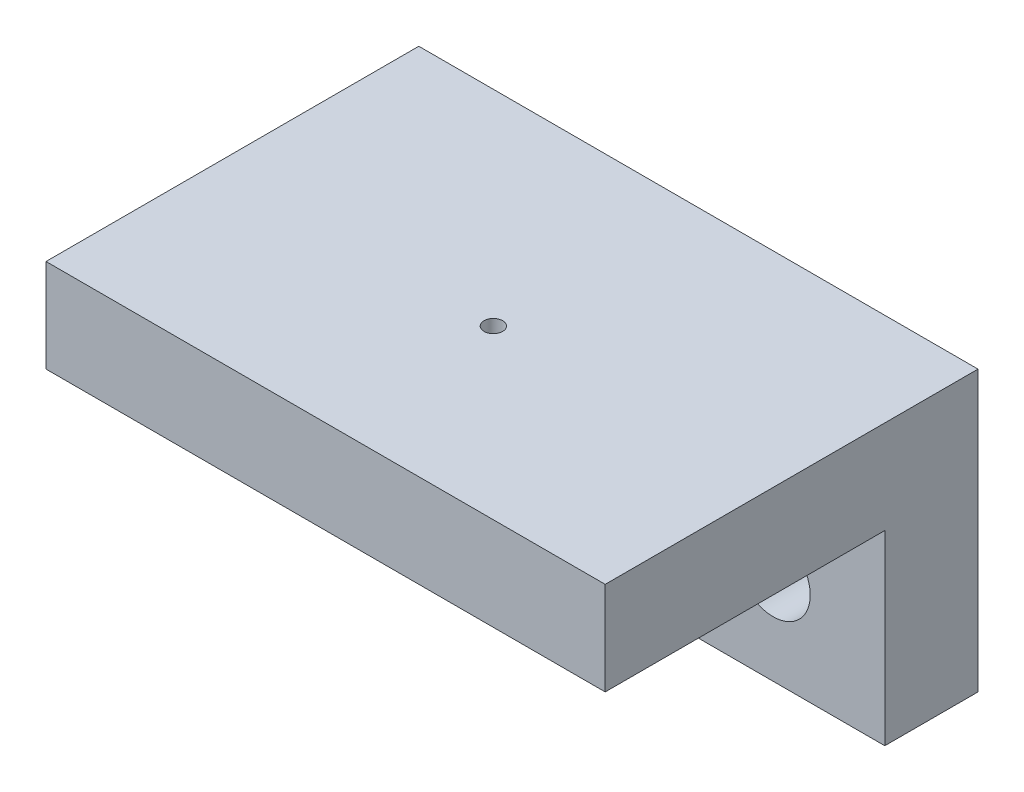
ISO-10303-21;
HEADER;
FILE_DESCRIPTION(('STEP AP214'),'2;1');
FILE_NAME('part.step','',(''),(''),'','','');
FILE_SCHEMA(('AUTOMOTIVE_DESIGN { 1 0 10303 214 1 1 1 1 }'));
ENDSEC;
DATA;
#1=APPLICATION_CONTEXT('core data for automotive mechanical design processes');
#2=APPLICATION_PROTOCOL_DEFINITION('international standard','automotive_design',2000,#1);
#3=PRODUCT_CONTEXT('',#1,'mechanical');
#4=PRODUCT('Part','Part','',(#3));
#5=PRODUCT_RELATED_PRODUCT_CATEGORY('part','',(#4));
#6=PRODUCT_DEFINITION_FORMATION('','',#4);
#7=PRODUCT_DEFINITION_CONTEXT('part definition',#1,'design');
#8=PRODUCT_DEFINITION('design','',#6,#7);
#9=PRODUCT_DEFINITION_SHAPE('','',#8);
#10=(LENGTH_UNIT() NAMED_UNIT(*) SI_UNIT(.MILLI.,.METRE.));
#11=(NAMED_UNIT(*) PLANE_ANGLE_UNIT() SI_UNIT($,.RADIAN.));
#12=(NAMED_UNIT(*) SI_UNIT($,.STERADIAN.) SOLID_ANGLE_UNIT());
#13=UNCERTAINTY_MEASURE_WITH_UNIT(LENGTH_MEASURE(1.E-05),#10,'distance_accuracy_value','');
#14=(GEOMETRIC_REPRESENTATION_CONTEXT(3) GLOBAL_UNCERTAINTY_ASSIGNED_CONTEXT((#13)) GLOBAL_UNIT_ASSIGNED_CONTEXT((#10,
#11,#12)) REPRESENTATION_CONTEXT('',''));
#15=CARTESIAN_POINT('',(0.,0.,0.));
#16=DIRECTION('',(0.,0.,1.));
#17=DIRECTION('',(1.,0.,0.));
#18=AXIS2_PLACEMENT_3D('',#15,#16,#17);
#19=CARTESIAN_POINT('',(0.,0.,5.));
#20=DIRECTION('',(0.,0.,-1.));
#21=DIRECTION('',(-1.,0.,0.));
#22=AXIS2_PLACEMENT_3D('',#19,#20,#21);
#23=PLANE('',#22);
#24=CARTESIAN_POINT('',(6.,5.,5.));
#25=DIRECTION('',(0.,0.,1.));
#26=DIRECTION('',(1.,0.,0.));
#27=AXIS2_PLACEMENT_3D('',#24,#25,#26);
#28=CIRCLE('',#27,2.);
#29=CARTESIAN_POINT('',(8.,5.,5.));
#30=VERTEX_POINT('',#29);
#31=EDGE_CURVE('E124',#30,#30,#28,.T.);
#32=ORIENTED_EDGE('',*,*,#31,.F.);
#33=EDGE_LOOP('',(#32));
#34=FACE_BOUND('',#33,.T.);
#35=CARTESIAN_POINT('',(24.,5.,5.));
#36=DIRECTION('',(0.,0.,1.));
#37=DIRECTION('',(1.,0.,0.));
#38=AXIS2_PLACEMENT_3D('',#35,#36,#37);
#39=CIRCLE('',#38,2.);
#40=CARTESIAN_POINT('',(26.,5.,5.));
#41=VERTEX_POINT('',#40);
#42=EDGE_CURVE('E115',#41,#41,#39,.T.);
#43=ORIENTED_EDGE('',*,*,#42,.F.);
#44=EDGE_LOOP('',(#43));
#45=FACE_BOUND('',#44,.T.);
#46=DIRECTION('',(1.,0.,0.));
#47=VECTOR('',#46,1.);
#48=CARTESIAN_POINT('',(0.,10.,5.));
#49=LINE('',#48,#47);
#50=CARTESIAN_POINT('',(0.,10.,5.));
#51=VERTEX_POINT('',#50);
#52=CARTESIAN_POINT('',(30.,10.,5.));
#53=VERTEX_POINT('',#52);
#54=EDGE_CURVE('E49',#51,#53,#49,.T.);
#55=ORIENTED_EDGE('',*,*,#54,.F.);
#56=DIRECTION('',(0.,-1.,0.));
#57=VECTOR('',#56,1.);
#58=CARTESIAN_POINT('',(0.,0.,5.));
#59=LINE('',#58,#57);
#60=CARTESIAN_POINT('',(0.,0.,5.));
#61=VERTEX_POINT('',#60);
#62=EDGE_CURVE('E86',#51,#61,#59,.T.);
#63=ORIENTED_EDGE('',*,*,#62,.T.);
#64=DIRECTION('',(1.,0.,0.));
#65=VECTOR('',#64,1.);
#66=CARTESIAN_POINT('',(0.,0.,5.));
#67=LINE('',#66,#65);
#68=CARTESIAN_POINT('',(30.,0.,5.));
#69=VERTEX_POINT('',#68);
#70=EDGE_CURVE('E55',#61,#69,#67,.T.);
#71=ORIENTED_EDGE('',*,*,#70,.T.);
#72=DIRECTION('',(0.,1.,0.));
#73=VECTOR('',#72,1.);
#74=CARTESIAN_POINT('',(30.,0.,5.));
#75=LINE('',#74,#73);
#76=EDGE_CURVE('E97',#69,#53,#75,.T.);
#77=ORIENTED_EDGE('',*,*,#76,.T.);
#78=EDGE_LOOP('',(#55,#63,#71,#77));
#79=FACE_BOUND('',#78,.T.);
#80=ADVANCED_FACE('F32',(#34,#45,#79),#23,.F.);
#81=CARTESIAN_POINT('',(0.,0.,5.));
#82=DIRECTION('',(1.,0.,0.));
#83=DIRECTION('',(0.,0.,-1.));
#84=AXIS2_PLACEMENT_3D('',#81,#82,#83);
#85=PLANE('',#84);
#86=DIRECTION('',(0.,-1.,0.));
#87=VECTOR('',#86,1.);
#88=CARTESIAN_POINT('',(0.,0.,0.));
#89=LINE('',#88,#87);
#90=CARTESIAN_POINT('',(0.,15.,0.));
#91=VERTEX_POINT('',#90);
#92=CARTESIAN_POINT('',(0.,0.,0.));
#93=VERTEX_POINT('',#92);
#94=EDGE_CURVE('E93',#91,#93,#89,.T.);
#95=ORIENTED_EDGE('',*,*,#94,.T.);
#96=DIRECTION('',(0.,0.,-1.));
#97=VECTOR('',#96,1.);
#98=CARTESIAN_POINT('',(0.,0.,5.));
#99=LINE('',#98,#97);
#100=EDGE_CURVE('E11',#61,#93,#99,.T.);
#101=ORIENTED_EDGE('',*,*,#100,.F.);
#102=ORIENTED_EDGE('',*,*,#62,.F.);
#103=DIRECTION('',(0.,0.,-1.));
#104=VECTOR('',#103,1.);
#105=CARTESIAN_POINT('',(0.,10.,20.));
#106=LINE('',#105,#104);
#107=CARTESIAN_POINT('',(0.,10.,20.));
#108=VERTEX_POINT('',#107);
#109=EDGE_CURVE('E101',#108,#51,#106,.T.);
#110=ORIENTED_EDGE('',*,*,#109,.F.);
#111=DIRECTION('',(0.,-1.,0.));
#112=VECTOR('',#111,1.);
#113=CARTESIAN_POINT('',(0.,15.,20.));
#114=LINE('',#113,#112);
#115=CARTESIAN_POINT('',(0.,15.,20.));
#116=VERTEX_POINT('',#115);
#117=EDGE_CURVE('E96',#116,#108,#114,.T.);
#118=ORIENTED_EDGE('',*,*,#117,.F.);
#119=DIRECTION('',(0.,0.,-1.));
#120=VECTOR('',#119,1.);
#121=CARTESIAN_POINT('',(0.,15.,5.));
#122=LINE('',#121,#120);
#123=EDGE_CURVE('E79',#116,#91,#122,.T.);
#124=ORIENTED_EDGE('',*,*,#123,.T.);
#125=EDGE_LOOP('',(#95,#101,#102,#110,#118,#124));
#126=FACE_BOUND('',#125,.T.);
#127=ADVANCED_FACE('F34',(#126),#85,.F.);
#128=CARTESIAN_POINT('',(0.,0.,5.));
#129=DIRECTION('',(0.,1.,0.));
#130=DIRECTION('',(0.,0.,1.));
#131=AXIS2_PLACEMENT_3D('',#128,#129,#130);
#132=PLANE('',#131);
#133=DIRECTION('',(1.,0.,0.));
#134=VECTOR('',#133,1.);
#135=CARTESIAN_POINT('',(0.,0.,0.));
#136=LINE('',#135,#134);
#137=CARTESIAN_POINT('',(30.,0.,0.));
#138=VERTEX_POINT('',#137);
#139=EDGE_CURVE('E100',#93,#138,#136,.T.);
#140=ORIENTED_EDGE('',*,*,#139,.T.);
#141=DIRECTION('',(0.,0.,-1.));
#142=VECTOR('',#141,1.);
#143=CARTESIAN_POINT('',(30.,0.,5.));
#144=LINE('',#143,#142);
#145=EDGE_CURVE('E41',#69,#138,#144,.T.);
#146=ORIENTED_EDGE('',*,*,#145,.F.);
#147=ORIENTED_EDGE('',*,*,#70,.F.);
#148=ORIENTED_EDGE('',*,*,#100,.T.);
#149=EDGE_LOOP('',(#140,#146,#147,#148));
#150=FACE_BOUND('',#149,.T.);
#151=ADVANCED_FACE('F158',(#150),#132,.F.);
#152=CARTESIAN_POINT('',(30.,0.,5.));
#153=DIRECTION('',(-1.,0.,0.));
#154=DIRECTION('',(0.,0.,1.));
#155=AXIS2_PLACEMENT_3D('',#152,#153,#154);
#156=PLANE('',#155);
#157=DIRECTION('',(0.,1.,0.));
#158=VECTOR('',#157,1.);
#159=CARTESIAN_POINT('',(30.,0.,0.));
#160=LINE('',#159,#158);
#161=CARTESIAN_POINT('',(30.,15.,0.));
#162=VERTEX_POINT('',#161);
#163=EDGE_CURVE('E87',#138,#162,#160,.T.);
#164=ORIENTED_EDGE('',*,*,#163,.T.);
#165=DIRECTION('',(0.,0.,-1.));
#166=VECTOR('',#165,1.);
#167=CARTESIAN_POINT('',(30.,15.,5.));
#168=LINE('',#167,#166);
#169=CARTESIAN_POINT('',(30.,15.,20.));
#170=VERTEX_POINT('',#169);
#171=EDGE_CURVE('E82',#170,#162,#168,.T.);
#172=ORIENTED_EDGE('',*,*,#171,.F.);
#173=DIRECTION('',(0.,1.,0.));
#174=VECTOR('',#173,1.);
#175=CARTESIAN_POINT('',(30.,15.,20.));
#176=LINE('',#175,#174);
#177=CARTESIAN_POINT('',(30.,10.,20.));
#178=VERTEX_POINT('',#177);
#179=EDGE_CURVE('E132',#178,#170,#176,.T.);
#180=ORIENTED_EDGE('',*,*,#179,.F.);
#181=DIRECTION('',(0.,0.,-1.));
#182=VECTOR('',#181,1.);
#183=CARTESIAN_POINT('',(30.,10.,20.));
#184=LINE('',#183,#182);
#185=EDGE_CURVE('E105',#178,#53,#184,.T.);
#186=ORIENTED_EDGE('',*,*,#185,.T.);
#187=ORIENTED_EDGE('',*,*,#76,.F.);
#188=ORIENTED_EDGE('',*,*,#145,.T.);
#189=EDGE_LOOP('',(#164,#172,#180,#186,#187,#188));
#190=FACE_BOUND('',#189,.T.);
#191=ADVANCED_FACE('F149',(#190),#156,.F.);
#192=CARTESIAN_POINT('',(0.,15.,5.));
#193=DIRECTION('',(0.,-1.,0.));
#194=DIRECTION('',(0.,0.,-1.));
#195=AXIS2_PLACEMENT_3D('',#192,#193,#194);
#196=PLANE('',#195);
#197=CARTESIAN_POINT('',(15.,15.,11.));
#198=DIRECTION('',(0.,-1.,0.));
#199=DIRECTION('',(0.,0.,-1.));
#200=AXIS2_PLACEMENT_3D('',#197,#198,#199);
#201=CIRCLE('',#200,0.500000000000001);
#202=CARTESIAN_POINT('',(15.,15.,10.5));
#203=VERTEX_POINT('',#202);
#204=EDGE_CURVE('E186',#203,#203,#201,.T.);
#205=ORIENTED_EDGE('',*,*,#204,.T.);
#206=EDGE_LOOP('',(#205));
#207=FACE_BOUND('',#206,.T.);
#208=DIRECTION('',(-1.,0.,0.));
#209=VECTOR('',#208,1.);
#210=CARTESIAN_POINT('',(0.,15.,0.));
#211=LINE('',#210,#209);
#212=EDGE_CURVE('E75',#162,#91,#211,.T.);
#213=ORIENTED_EDGE('',*,*,#212,.T.);
#214=ORIENTED_EDGE('',*,*,#123,.F.);
#215=DIRECTION('',(-1.,0.,0.));
#216=VECTOR('',#215,1.);
#217=CARTESIAN_POINT('',(0.,15.,20.));
#218=LINE('',#217,#216);
#219=EDGE_CURVE('E135',#170,#116,#218,.T.);
#220=ORIENTED_EDGE('',*,*,#219,.F.);
#221=ORIENTED_EDGE('',*,*,#171,.T.);
#222=EDGE_LOOP('',(#213,#214,#220,#221));
#223=FACE_BOUND('',#222,.T.);
#224=ADVANCED_FACE('F77',(#207,#223),#196,.F.);
#225=CARTESIAN_POINT('',(0.,0.,0.));
#226=DIRECTION('',(0.,0.,-1.));
#227=DIRECTION('',(-1.,0.,0.));
#228=AXIS2_PLACEMENT_3D('',#225,#226,#227);
#229=PLANE('',#228);
#230=CARTESIAN_POINT('',(6.,5.,0.));
#231=DIRECTION('',(0.,0.,-1.));
#232=DIRECTION('',(-1.,0.,0.));
#233=AXIS2_PLACEMENT_3D('',#230,#231,#232);
#234=CIRCLE('',#233,2.);
#235=CARTESIAN_POINT('',(4.,5.,0.));
#236=VERTEX_POINT('',#235);
#237=EDGE_CURVE('E36',#236,#236,#234,.T.);
#238=ORIENTED_EDGE('',*,*,#237,.F.);
#239=EDGE_LOOP('',(#238));
#240=FACE_BOUND('',#239,.T.);
#241=CARTESIAN_POINT('',(24.,5.,0.));
#242=DIRECTION('',(0.,0.,-1.));
#243=DIRECTION('',(-1.,0.,0.));
#244=AXIS2_PLACEMENT_3D('',#241,#242,#243);
#245=CIRCLE('',#244,2.);
#246=CARTESIAN_POINT('',(22.,5.,0.));
#247=VERTEX_POINT('',#246);
#248=EDGE_CURVE('E113',#247,#247,#245,.T.);
#249=ORIENTED_EDGE('',*,*,#248,.F.);
#250=EDGE_LOOP('',(#249));
#251=FACE_BOUND('',#250,.T.);
#252=ORIENTED_EDGE('',*,*,#94,.F.);
#253=ORIENTED_EDGE('',*,*,#212,.F.);
#254=ORIENTED_EDGE('',*,*,#163,.F.);
#255=ORIENTED_EDGE('',*,*,#139,.F.);
#256=EDGE_LOOP('',(#252,#253,#254,#255));
#257=FACE_BOUND('',#256,.T.);
#258=ADVANCED_FACE('F99',(#240,#251,#257),#229,.T.);
#259=CARTESIAN_POINT('',(0.,10.,20.));
#260=DIRECTION('',(0.,1.,0.));
#261=DIRECTION('',(0.,0.,1.));
#262=AXIS2_PLACEMENT_3D('',#259,#260,#261);
#263=PLANE('',#262);
#264=CARTESIAN_POINT('',(15.,10.,11.));
#265=DIRECTION('',(0.,-1.,0.));
#266=DIRECTION('',(0.,0.,-1.));
#267=AXIS2_PLACEMENT_3D('',#264,#265,#266);
#268=CIRCLE('',#267,0.500000000000001);
#269=CARTESIAN_POINT('',(15.,10.,10.5));
#270=VERTEX_POINT('',#269);
#271=EDGE_CURVE('E188',#270,#270,#268,.T.);
#272=ORIENTED_EDGE('',*,*,#271,.F.);
#273=EDGE_LOOP('',(#272));
#274=FACE_BOUND('',#273,.T.);
#275=ORIENTED_EDGE('',*,*,#54,.T.);
#276=ORIENTED_EDGE('',*,*,#185,.F.);
#277=DIRECTION('',(1.,0.,0.));
#278=VECTOR('',#277,1.);
#279=CARTESIAN_POINT('',(0.,10.,20.));
#280=LINE('',#279,#278);
#281=EDGE_CURVE('E129',#108,#178,#280,.T.);
#282=ORIENTED_EDGE('',*,*,#281,.F.);
#283=ORIENTED_EDGE('',*,*,#109,.T.);
#284=EDGE_LOOP('',(#275,#276,#282,#283));
#285=FACE_BOUND('',#284,.T.);
#286=ADVANCED_FACE('F145',(#274,#285),#263,.F.);
#287=CARTESIAN_POINT('',(0.,0.,20.));
#288=DIRECTION('',(0.,0.,1.));
#289=DIRECTION('',(1.,0.,0.));
#290=AXIS2_PLACEMENT_3D('',#287,#288,#289);
#291=PLANE('',#290);
#292=ORIENTED_EDGE('',*,*,#117,.T.);
#293=ORIENTED_EDGE('',*,*,#281,.T.);
#294=ORIENTED_EDGE('',*,*,#179,.T.);
#295=ORIENTED_EDGE('',*,*,#219,.T.);
#296=EDGE_LOOP('',(#292,#293,#294,#295));
#297=FACE_BOUND('',#296,.T.);
#298=ADVANCED_FACE('F153',(#297),#291,.T.);
#299=CARTESIAN_POINT('',(24.,5.,-10.));
#300=DIRECTION('',(0.,0.,1.));
#301=DIRECTION('',(1.,0.,0.));
#302=AXIS2_PLACEMENT_3D('',#299,#300,#301);
#303=CYLINDRICAL_SURFACE('',#302,2.);
#304=ORIENTED_EDGE('',*,*,#248,.T.);
#305=EDGE_LOOP('',(#304));
#306=FACE_BOUND('',#305,.T.);
#307=ORIENTED_EDGE('',*,*,#42,.T.);
#308=EDGE_LOOP('',(#307));
#309=FACE_BOUND('',#308,.T.);
#310=ADVANCED_FACE('F200',(#306,#309),#303,.F.);
#311=CARTESIAN_POINT('',(6.,5.,-10.));
#312=DIRECTION('',(0.,0.,1.));
#313=DIRECTION('',(1.,0.,0.));
#314=AXIS2_PLACEMENT_3D('',#311,#312,#313);
#315=CYLINDRICAL_SURFACE('',#314,2.);
#316=ORIENTED_EDGE('',*,*,#237,.T.);
#317=EDGE_LOOP('',(#316));
#318=FACE_BOUND('',#317,.T.);
#319=ORIENTED_EDGE('',*,*,#31,.T.);
#320=EDGE_LOOP('',(#319));
#321=FACE_BOUND('',#320,.T.);
#322=ADVANCED_FACE('F204',(#318,#321),#315,.F.);
#323=CARTESIAN_POINT('',(15.,20.,11.));
#324=DIRECTION('',(0.,-1.,0.));
#325=DIRECTION('',(0.,0.,-1.));
#326=AXIS2_PLACEMENT_3D('',#323,#324,#325);
#327=CYLINDRICAL_SURFACE('',#326,0.500000000000001);
#328=ORIENTED_EDGE('',*,*,#271,.T.);
#329=EDGE_LOOP('',(#328));
#330=FACE_BOUND('',#329,.T.);
#331=ORIENTED_EDGE('',*,*,#204,.F.);
#332=EDGE_LOOP('',(#331));
#333=FACE_BOUND('',#332,.T.);
#334=ADVANCED_FACE('F194',(#330,#333),#327,.F.);
#335=CLOSED_SHELL('',(#80,#127,#151,#191,#224,#258,#286,#298,#310,#322,#334));
#336=MANIFOLD_SOLID_BREP('B2',#335);
#337=ADVANCED_BREP_SHAPE_REPRESENTATION('',(#18,#336),#14);
#338=SHAPE_DEFINITION_REPRESENTATION(#9,#337);
ENDSEC;
END-ISO-10303-21;
